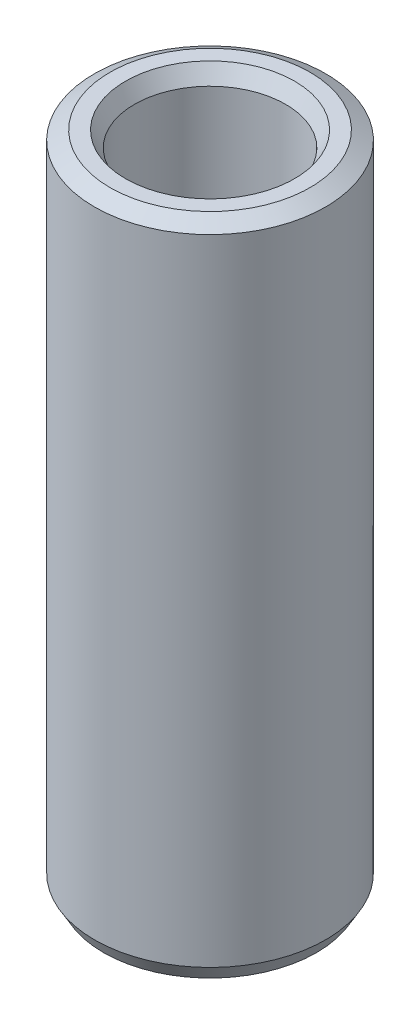
ISO-10303-21;
HEADER;
FILE_DESCRIPTION(('STEP AP214'),'2;1');
FILE_NAME('part.step','',(''),(''),'','','');
FILE_SCHEMA(('AUTOMOTIVE_DESIGN { 1 0 10303 214 1 1 1 1 }'));
ENDSEC;
DATA;
#1=APPLICATION_CONTEXT('core data for automotive mechanical design processes');
#2=APPLICATION_PROTOCOL_DEFINITION('international standard','automotive_design',2000,#1);
#3=PRODUCT_CONTEXT('',#1,'mechanical');
#4=PRODUCT('Part','Part','',(#3));
#5=PRODUCT_RELATED_PRODUCT_CATEGORY('part','',(#4));
#6=PRODUCT_DEFINITION_FORMATION('','',#4);
#7=PRODUCT_DEFINITION_CONTEXT('part definition',#1,'design');
#8=PRODUCT_DEFINITION('design','',#6,#7);
#9=PRODUCT_DEFINITION_SHAPE('','',#8);
#10=(LENGTH_UNIT() NAMED_UNIT(*) SI_UNIT(.MILLI.,.METRE.));
#11=(NAMED_UNIT(*) PLANE_ANGLE_UNIT() SI_UNIT($,.RADIAN.));
#12=(NAMED_UNIT(*) SI_UNIT($,.STERADIAN.) SOLID_ANGLE_UNIT());
#13=UNCERTAINTY_MEASURE_WITH_UNIT(LENGTH_MEASURE(1.E-05),#10,'distance_accuracy_value','');
#14=(GEOMETRIC_REPRESENTATION_CONTEXT(3) GLOBAL_UNCERTAINTY_ASSIGNED_CONTEXT((#13)) GLOBAL_UNIT_ASSIGNED_CONTEXT((#10,
#11,#12)) REPRESENTATION_CONTEXT('',''));
#15=CARTESIAN_POINT('',(0.,0.,0.));
#16=DIRECTION('',(0.,0.,1.));
#17=DIRECTION('',(1.,0.,0.));
#18=AXIS2_PLACEMENT_3D('',#15,#16,#17);
#19=CARTESIAN_POINT('',(0.,242.450909699492,0.));
#20=DIRECTION('',(0.,-1.,0.));
#21=DIRECTION('',(0.,0.,-1.));
#22=AXIS2_PLACEMENT_3D('',#19,#20,#21);
#23=CYLINDRICAL_SURFACE('',#22,42.5);
#24=CARTESIAN_POINT('',(0.,5.72259700790168,0.));
#25=DIRECTION('',(0.,1.,0.));
#26=DIRECTION('',(0.,0.,1.));
#27=AXIS2_PLACEMENT_3D('',#24,#25,#26);
#28=CIRCLE('',#27,42.5);
#29=CARTESIAN_POINT('',(0.,5.72259700790168,42.5));
#30=VERTEX_POINT('',#29);
#31=EDGE_CURVE('E10',#30,#30,#28,.T.);
#32=ORIENTED_EDGE('',*,*,#31,.T.);
#33=EDGE_LOOP('',(#32));
#34=FACE_BOUND('',#33,.T.);
#35=CARTESIAN_POINT('',(0.,239.146966776516,0.));
#36=DIRECTION('',(0.,1.,0.));
#37=DIRECTION('',(0.,0.,1.));
#38=AXIS2_PLACEMENT_3D('',#35,#36,#37);
#39=CIRCLE('',#38,42.5);
#40=CARTESIAN_POINT('',(0.,239.146966776516,42.5));
#41=VERTEX_POINT('',#40);
#42=EDGE_CURVE('E50',#41,#41,#39,.F.);
#43=ORIENTED_EDGE('',*,*,#42,.T.);
#44=EDGE_LOOP('',(#43));
#45=FACE_BOUND('',#44,.T.);
#46=ADVANCED_FACE('F39',(#34,#45),#23,.T.);
#47=CARTESIAN_POINT('',(0.,242.450909699492,0.));
#48=DIRECTION('',(0.,1.,0.));
#49=DIRECTION('',(0.,0.,1.));
#50=AXIS2_PLACEMENT_3D('',#47,#48,#49);
#51=PLANE('',#50);
#52=CARTESIAN_POINT('',(0.,242.450909699492,0.));
#53=DIRECTION('',(0.,1.,0.));
#54=DIRECTION('',(0.,0.,1.));
#55=AXIS2_PLACEMENT_3D('',#52,#53,#54);
#56=CIRCLE('',#55,31.0907441246187);
#57=CARTESIAN_POINT('',(0.,242.450909699492,31.0907441246187));
#58=VERTEX_POINT('',#57);
#59=EDGE_CURVE('E58',#58,#58,#56,.F.);
#60=ORIENTED_EDGE('',*,*,#59,.T.);
#61=EDGE_LOOP('',(#60));
#62=FACE_BOUND('',#61,.T.);
#63=CARTESIAN_POINT('',(0.,242.450909699492,0.));
#64=DIRECTION('',(0.,1.,0.));
#65=DIRECTION('',(0.,0.,1.));
#66=AXIS2_PLACEMENT_3D('',#63,#64,#65);
#67=CIRCLE('',#66,36.7774029920983);
#68=CARTESIAN_POINT('',(0.,242.450909699492,36.7774029920983));
#69=VERTEX_POINT('',#68);
#70=EDGE_CURVE('E61',#69,#69,#67,.T.);
#71=ORIENTED_EDGE('',*,*,#70,.T.);
#72=EDGE_LOOP('',(#71));
#73=FACE_BOUND('',#72,.T.);
#74=ADVANCED_FACE('F88',(#62,#73),#51,.T.);
#75=CARTESIAN_POINT('',(0.,0.,0.));
#76=DIRECTION('',(0.,1.,0.));
#77=DIRECTION('',(0.,0.,1.));
#78=AXIS2_PLACEMENT_3D('',#75,#76,#77);
#79=PLANE('',#78);
#80=CARTESIAN_POINT('',(0.,0.,0.));
#81=DIRECTION('',(0.,1.,0.));
#82=DIRECTION('',(0.,0.,1.));
#83=AXIS2_PLACEMENT_3D('',#80,#81,#82);
#84=CIRCLE('',#83,33.5093982095447);
#85=CARTESIAN_POINT('',(0.,0.,33.5093982095447));
#86=VERTEX_POINT('',#85);
#87=EDGE_CURVE('E51',#86,#86,#84,.T.);
#88=ORIENTED_EDGE('',*,*,#87,.T.);
#89=EDGE_LOOP('',(#88));
#90=FACE_BOUND('',#89,.T.);
#91=CARTESIAN_POINT('',(0.,0.,0.));
#92=DIRECTION('',(0.,1.,0.));
#93=DIRECTION('',(0.,0.,1.));
#94=AXIS2_PLACEMENT_3D('',#91,#92,#93);
#95=CIRCLE('',#94,39.1960570770242);
#96=CARTESIAN_POINT('',(0.,0.,39.1960570770242));
#97=VERTEX_POINT('',#96);
#98=EDGE_CURVE('E54',#97,#97,#95,.F.);
#99=ORIENTED_EDGE('',*,*,#98,.T.);
#100=EDGE_LOOP('',(#99));
#101=FACE_BOUND('',#100,.T.);
#102=ADVANCED_FACE('F83',(#90,#101),#79,.F.);
#103=CARTESIAN_POINT('',(0.,242.450909699492,0.));
#104=DIRECTION('',(0.,-1.,0.));
#105=DIRECTION('',(0.,0.,-1.));
#106=AXIS2_PLACEMENT_3D('',#103,#104,#105);
#107=CYLINDRICAL_SURFACE('',#106,27.7868012016429);
#108=CARTESIAN_POINT('',(0.,236.72831269159,0.));
#109=DIRECTION('',(0.,1.,0.));
#110=DIRECTION('',(0.,0.,1.));
#111=AXIS2_PLACEMENT_3D('',#108,#109,#110);
#112=CIRCLE('',#111,27.7868012016429);
#113=CARTESIAN_POINT('',(0.,236.72831269159,27.7868012016429));
#114=VERTEX_POINT('',#113);
#115=EDGE_CURVE('E67',#114,#114,#112,.T.);
#116=ORIENTED_EDGE('',*,*,#115,.T.);
#117=EDGE_LOOP('',(#116));
#118=FACE_BOUND('',#117,.T.);
#119=CARTESIAN_POINT('',(0.,3.30394292297587,0.));
#120=DIRECTION('',(0.,1.,0.));
#121=DIRECTION('',(0.,0.,1.));
#122=AXIS2_PLACEMENT_3D('',#119,#120,#121);
#123=CIRCLE('',#122,27.7868012016429);
#124=CARTESIAN_POINT('',(0.,3.30394292297587,27.7868012016429));
#125=VERTEX_POINT('',#124);
#126=EDGE_CURVE('E69',#125,#125,#123,.F.);
#127=ORIENTED_EDGE('',*,*,#126,.T.);
#128=EDGE_LOOP('',(#127));
#129=FACE_BOUND('',#128,.T.);
#130=ADVANCED_FACE('F71',(#118,#129),#107,.F.);
#131=CARTESIAN_POINT('',(0.,236.72831269159,0.));
#132=DIRECTION('',(0.,1.,0.));
#133=DIRECTION('',(0.,0.,1.));
#134=AXIS2_PLACEMENT_3D('',#131,#132,#133);
#135=CONICAL_SURFACE('',#134,27.7868012016429,0.523598775598296);
#136=ORIENTED_EDGE('',*,*,#59,.F.);
#137=EDGE_LOOP('',(#136));
#138=FACE_BOUND('',#137,.T.);
#139=ORIENTED_EDGE('',*,*,#115,.F.);
#140=EDGE_LOOP('',(#139));
#141=FACE_BOUND('',#140,.T.);
#142=ADVANCED_FACE('F77',(#138,#141),#135,.F.);
#143=CARTESIAN_POINT('',(0.,0.,0.));
#144=DIRECTION('',(0.,-1.,0.));
#145=DIRECTION('',(0.,0.,-1.));
#146=AXIS2_PLACEMENT_3D('',#143,#144,#145);
#147=CONICAL_SURFACE('',#146,33.5093982095447,1.04719755119659);
#148=ORIENTED_EDGE('',*,*,#126,.F.);
#149=EDGE_LOOP('',(#148));
#150=FACE_BOUND('',#149,.T.);
#151=ORIENTED_EDGE('',*,*,#87,.F.);
#152=EDGE_LOOP('',(#151));
#153=FACE_BOUND('',#152,.T.);
#154=ADVANCED_FACE('F73',(#150,#153),#147,.F.);
#155=CARTESIAN_POINT('',(0.,5.72259700790168,0.));
#156=DIRECTION('',(0.,1.,0.));
#157=DIRECTION('',(0.,0.,1.));
#158=AXIS2_PLACEMENT_3D('',#155,#156,#157);
#159=CONICAL_SURFACE('',#158,42.5,0.523598775598305);
#160=ORIENTED_EDGE('',*,*,#98,.F.);
#161=EDGE_LOOP('',(#160));
#162=FACE_BOUND('',#161,.T.);
#163=ORIENTED_EDGE('',*,*,#31,.F.);
#164=EDGE_LOOP('',(#163));
#165=FACE_BOUND('',#164,.T.);
#166=ADVANCED_FACE('F76',(#162,#165),#159,.T.);
#167=CARTESIAN_POINT('',(0.,242.450909699492,0.));
#168=DIRECTION('',(0.,-1.,0.));
#169=DIRECTION('',(0.,0.,-1.));
#170=AXIS2_PLACEMENT_3D('',#167,#168,#169);
#171=CONICAL_SURFACE('',#170,36.7774029920983,1.04719755119659);
#172=ORIENTED_EDGE('',*,*,#42,.F.);
#173=EDGE_LOOP('',(#172));
#174=FACE_BOUND('',#173,.T.);
#175=ORIENTED_EDGE('',*,*,#70,.F.);
#176=EDGE_LOOP('',(#175));
#177=FACE_BOUND('',#176,.T.);
#178=ADVANCED_FACE('F45',(#174,#177),#171,.T.);
#179=CLOSED_SHELL('',(#46,#74,#102,#130,#142,#154,#166,#178));
#180=MANIFOLD_SOLID_BREP('B2',#179);
#181=ADVANCED_BREP_SHAPE_REPRESENTATION('',(#18,#180),#14);
#182=SHAPE_DEFINITION_REPRESENTATION(#9,#181);
ENDSEC;
END-ISO-10303-21;
